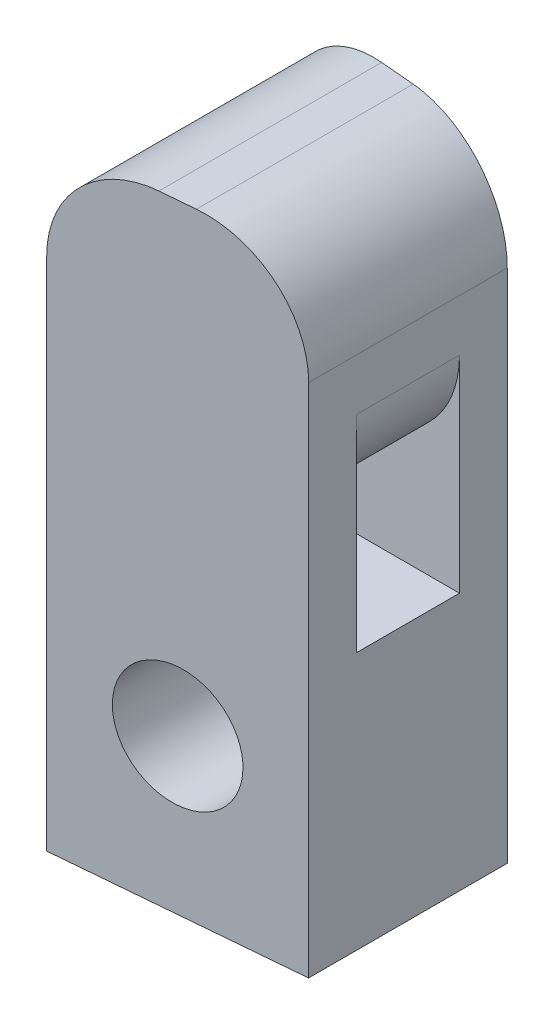
ISO-10303-21;
HEADER;
FILE_DESCRIPTION(('STEP AP214'),'2;1');
FILE_NAME('part.step','',(''),(''),'','','');
FILE_SCHEMA(('AUTOMOTIVE_DESIGN { 1 0 10303 214 1 1 1 1 }'));
ENDSEC;
DATA;
#1=APPLICATION_CONTEXT('core data for automotive mechanical design processes');
#2=APPLICATION_PROTOCOL_DEFINITION('international standard','automotive_design',2000,#1);
#3=PRODUCT_CONTEXT('',#1,'mechanical');
#4=PRODUCT('Part','Part','',(#3));
#5=PRODUCT_RELATED_PRODUCT_CATEGORY('part','',(#4));
#6=PRODUCT_DEFINITION_FORMATION('','',#4);
#7=PRODUCT_DEFINITION_CONTEXT('part definition',#1,'design');
#8=PRODUCT_DEFINITION('design','',#6,#7);
#9=PRODUCT_DEFINITION_SHAPE('','',#8);
#10=(LENGTH_UNIT() NAMED_UNIT(*) SI_UNIT(.MILLI.,.METRE.));
#11=(NAMED_UNIT(*) PLANE_ANGLE_UNIT() SI_UNIT($,.RADIAN.));
#12=(NAMED_UNIT(*) SI_UNIT($,.STERADIAN.) SOLID_ANGLE_UNIT());
#13=UNCERTAINTY_MEASURE_WITH_UNIT(LENGTH_MEASURE(1.E-05),#10,'distance_accuracy_value','');
#14=(GEOMETRIC_REPRESENTATION_CONTEXT(3) GLOBAL_UNCERTAINTY_ASSIGNED_CONTEXT((#13)) GLOBAL_UNIT_ASSIGNED_CONTEXT((#10,
#11,#12)) REPRESENTATION_CONTEXT('',''));
#15=CARTESIAN_POINT('',(0.,0.,0.));
#16=DIRECTION('',(0.,0.,1.));
#17=DIRECTION('',(1.,0.,0.));
#18=AXIS2_PLACEMENT_3D('',#15,#16,#17);
#19=CARTESIAN_POINT('',(2.335,10.,1.92642794133393));
#20=DIRECTION('',(-1.,0.,0.));
#21=DIRECTION('',(0.,0.,1.));
#22=AXIS2_PLACEMENT_3D('',#19,#20,#21);
#23=PLANE('',#22);
#24=DIRECTION('',(0.,-1.,0.));
#25=VECTOR('',#24,1.);
#26=CARTESIAN_POINT('',(2.335,5.,1.));
#27=LINE('',#26,#25);
#28=CARTESIAN_POINT('',(2.335,9.,1.));
#29=VERTEX_POINT('',#28);
#30=CARTESIAN_POINT('',(2.335,5.,1.));
#31=VERTEX_POINT('',#30);
#32=EDGE_CURVE('E151',#29,#31,#27,.T.);
#33=ORIENTED_EDGE('',*,*,#32,.F.);
#34=DIRECTION('',(0.,0.,1.));
#35=VECTOR('',#34,1.);
#36=CARTESIAN_POINT('',(2.335,9.,1.92642794133393));
#37=LINE('',#36,#35);
#38=CARTESIAN_POINT('',(2.335,9.,-1.));
#39=VERTEX_POINT('',#38);
#40=EDGE_CURVE('E223',#29,#39,#37,.F.);
#41=ORIENTED_EDGE('',*,*,#40,.T.);
#42=DIRECTION('',(0.,1.,0.));
#43=VECTOR('',#42,1.);
#44=CARTESIAN_POINT('',(2.335,5.,-1.));
#45=LINE('',#44,#43);
#46=CARTESIAN_POINT('',(2.335,5.,-1.));
#47=VERTEX_POINT('',#46);
#48=EDGE_CURVE('E156',#47,#39,#45,.T.);
#49=ORIENTED_EDGE('',*,*,#48,.F.);
#50=DIRECTION('',(0.,0.,-1.));
#51=VECTOR('',#50,1.);
#52=CARTESIAN_POINT('',(2.335,5.,1.));
#53=LINE('',#52,#51);
#54=EDGE_CURVE('E142',#31,#47,#53,.T.);
#55=ORIENTED_EDGE('',*,*,#54,.F.);
#56=EDGE_LOOP('',(#33,#41,#49,#55));
#57=FACE_BOUND('',#56,.T.);
#58=DIRECTION('',(0.,-1.,0.));
#59=VECTOR('',#58,1.);
#60=CARTESIAN_POINT('',(2.335,10.,-1.92642794133393));
#61=LINE('',#60,#59);
#62=CARTESIAN_POINT('',(2.335,10.,-1.92642794133393));
#63=VERTEX_POINT('',#62);
#64=CARTESIAN_POINT('',(2.335,0.,-1.92642794133393));
#65=VERTEX_POINT('',#64);
#66=EDGE_CURVE('E206',#63,#65,#61,.T.);
#67=ORIENTED_EDGE('',*,*,#66,.F.);
#68=DIRECTION('',(0.,0.,-1.));
#69=VECTOR('',#68,1.);
#70=CARTESIAN_POINT('',(2.335,10.,1.92642794133393));
#71=LINE('',#70,#69);
#72=CARTESIAN_POINT('',(2.335,10.,1.92642794133393));
#73=VERTEX_POINT('',#72);
#74=EDGE_CURVE('E226',#63,#73,#71,.F.);
#75=ORIENTED_EDGE('',*,*,#74,.T.);
#76=DIRECTION('',(0.,-1.,0.));
#77=VECTOR('',#76,1.);
#78=CARTESIAN_POINT('',(2.335,10.,1.92642794133393));
#79=LINE('',#78,#77);
#80=CARTESIAN_POINT('',(2.335,0.,1.92642794133393));
#81=VERTEX_POINT('',#80);
#82=EDGE_CURVE('E197',#73,#81,#79,.T.);
#83=ORIENTED_EDGE('',*,*,#82,.T.);
#84=DIRECTION('',(0.,0.,-1.));
#85=VECTOR('',#84,1.);
#86=CARTESIAN_POINT('',(2.335,0.,1.92642794133393));
#87=LINE('',#86,#85);
#88=EDGE_CURVE('E181',#81,#65,#87,.T.);
#89=ORIENTED_EDGE('',*,*,#88,.T.);
#90=EDGE_LOOP('',(#67,#75,#83,#89));
#91=FACE_BOUND('',#90,.T.);
#92=ADVANCED_FACE('F45',(#57,#91),#23,.F.);
#93=CARTESIAN_POINT('',(-2.335,10.,-2.335));
#94=DIRECTION('',(-0.0871557427476583,0.,0.996194698091746));
#95=DIRECTION('',(0.996194698091746,0.,0.0871557427476583));
#96=AXIS2_PLACEMENT_3D('',#93,#94,#95);
#97=PLANE('',#96);
#98=CARTESIAN_POINT('',(0.,3.,-2.13071397066697));
#99=DIRECTION('',(-0.0871557427476583,0.,0.996194698091746));
#100=DIRECTION('',(0.996194698091746,0.,0.0871557427476583));
#101=AXIS2_PLACEMENT_3D('',#98,#99,#100);
#102=ELLIPSE('',#101,1.169450110738,1.165);
#103=CARTESIAN_POINT('',(1.165,3.,-2.02878967765926));
#104=VERTEX_POINT('',#103);
#105=EDGE_CURVE('E263',#104,#104,#102,.T.);
#106=ORIENTED_EDGE('',*,*,#105,.T.);
#107=EDGE_LOOP('',(#106));
#108=FACE_BOUND('',#107,.T.);
#109=DIRECTION('',(-0.996194698091746,0.,-0.0871557427476583));
#110=VECTOR('',#109,1.);
#111=CARTESIAN_POINT('',(2.335,12.,-1.92642794133393));
#112=LINE('',#111,#110);
#113=CARTESIAN_POINT('',(0.334999999999999,12.,-2.10140526838578));
#114=VERTEX_POINT('',#113);
#115=CARTESIAN_POINT('',(-0.335,12.,-2.16002267294815));
#116=VERTEX_POINT('',#115);
#117=EDGE_CURVE('E176',#114,#116,#112,.T.);
#118=ORIENTED_EDGE('',*,*,#117,.F.);
#119=CARTESIAN_POINT('',(0.335,10.,-2.10140526838578));
#120=DIRECTION('',(-0.0871557427476583,0.,0.996194698091746));
#121=DIRECTION('',(0.996194698091746,0.,0.0871557427476583));
#122=AXIS2_PLACEMENT_3D('',#119,#120,#121);
#123=ELLIPSE('',#122,2.00763967508669,2.);
#124=EDGE_CURVE('E220',#114,#63,#123,.F.);
#125=ORIENTED_EDGE('',*,*,#124,.T.);
#126=ORIENTED_EDGE('',*,*,#66,.T.);
#127=DIRECTION('',(-0.996194698091746,0.,-0.0871557427476583));
#128=VECTOR('',#127,1.);
#129=CARTESIAN_POINT('',(-2.335,0.,-2.335));
#130=LINE('',#129,#128);
#131=CARTESIAN_POINT('',(-2.335,0.,-2.335));
#132=VERTEX_POINT('',#131);
#133=EDGE_CURVE('E185',#65,#132,#130,.T.);
#134=ORIENTED_EDGE('',*,*,#133,.T.);
#135=DIRECTION('',(0.,-1.,0.));
#136=VECTOR('',#135,1.);
#137=CARTESIAN_POINT('',(-2.335,10.,-2.335));
#138=LINE('',#137,#136);
#139=CARTESIAN_POINT('',(-2.335,10.,-2.335));
#140=VERTEX_POINT('',#139);
#141=EDGE_CURVE('E203',#140,#132,#138,.T.);
#142=ORIENTED_EDGE('',*,*,#141,.F.);
#143=CARTESIAN_POINT('',(-0.335,10.,-2.16002267294815));
#144=DIRECTION('',(-0.0871557427476583,0.,0.996194698091746));
#145=DIRECTION('',(-0.996194698091746,0.,-0.0871557427476583));
#146=AXIS2_PLACEMENT_3D('',#143,#144,#145);
#147=ELLIPSE('',#146,2.00763967508669,2.);
#148=EDGE_CURVE('E217',#140,#116,#147,.F.);
#149=ORIENTED_EDGE('',*,*,#148,.T.);
#150=EDGE_LOOP('',(#118,#125,#126,#134,#142,#149));
#151=FACE_BOUND('',#150,.T.);
#152=ADVANCED_FACE('F288',(#108,#151),#97,.F.);
#153=CARTESIAN_POINT('',(-2.335,10.,2.335));
#154=DIRECTION('',(1.,0.,0.));
#155=DIRECTION('',(0.,0.,-1.));
#156=AXIS2_PLACEMENT_3D('',#153,#154,#155);
#157=PLANE('',#156);
#158=DIRECTION('',(0.,-1.,0.));
#159=VECTOR('',#158,1.);
#160=CARTESIAN_POINT('',(-2.335,5.,-1.));
#161=LINE('',#160,#159);
#162=CARTESIAN_POINT('',(-2.335,9.,-1.));
#163=VERTEX_POINT('',#162);
#164=CARTESIAN_POINT('',(-2.335,5.,-1.));
#165=VERTEX_POINT('',#164);
#166=EDGE_CURVE('E177',#163,#165,#161,.T.);
#167=ORIENTED_EDGE('',*,*,#166,.F.);
#168=DIRECTION('',(0.,0.,-1.));
#169=VECTOR('',#168,1.);
#170=CARTESIAN_POINT('',(-2.335,9.,2.335));
#171=LINE('',#170,#169);
#172=CARTESIAN_POINT('',(-2.335,9.,1.));
#173=VERTEX_POINT('',#172);
#174=EDGE_CURVE('E235',#163,#173,#171,.F.);
#175=ORIENTED_EDGE('',*,*,#174,.T.);
#176=DIRECTION('',(0.,1.,0.));
#177=VECTOR('',#176,1.);
#178=CARTESIAN_POINT('',(-2.335,5.,1.));
#179=LINE('',#178,#177);
#180=CARTESIAN_POINT('',(-2.335,5.,1.));
#181=VERTEX_POINT('',#180);
#182=EDGE_CURVE('E168',#181,#173,#179,.T.);
#183=ORIENTED_EDGE('',*,*,#182,.F.);
#184=DIRECTION('',(0.,0.,1.));
#185=VECTOR('',#184,1.);
#186=CARTESIAN_POINT('',(-2.335,5.,1.));
#187=LINE('',#186,#185);
#188=EDGE_CURVE('E145',#165,#181,#187,.T.);
#189=ORIENTED_EDGE('',*,*,#188,.F.);
#190=EDGE_LOOP('',(#167,#175,#183,#189));
#191=FACE_BOUND('',#190,.T.);
#192=DIRECTION('',(0.,-1.,0.));
#193=VECTOR('',#192,1.);
#194=CARTESIAN_POINT('',(-2.335,10.,2.335));
#195=LINE('',#194,#193);
#196=CARTESIAN_POINT('',(-2.335,10.,2.335));
#197=VERTEX_POINT('',#196);
#198=CARTESIAN_POINT('',(-2.335,0.,2.335));
#199=VERTEX_POINT('',#198);
#200=EDGE_CURVE('E200',#197,#199,#195,.T.);
#201=ORIENTED_EDGE('',*,*,#200,.F.);
#202=DIRECTION('',(0.,0.,1.));
#203=VECTOR('',#202,1.);
#204=CARTESIAN_POINT('',(-2.335,10.,-2.335));
#205=LINE('',#204,#203);
#206=EDGE_CURVE('E239',#197,#140,#205,.F.);
#207=ORIENTED_EDGE('',*,*,#206,.T.);
#208=ORIENTED_EDGE('',*,*,#141,.T.);
#209=DIRECTION('',(0.,0.,1.));
#210=VECTOR('',#209,1.);
#211=CARTESIAN_POINT('',(-2.335,0.,2.335));
#212=LINE('',#211,#210);
#213=EDGE_CURVE('E189',#132,#199,#212,.T.);
#214=ORIENTED_EDGE('',*,*,#213,.T.);
#215=EDGE_LOOP('',(#201,#207,#208,#214));
#216=FACE_BOUND('',#215,.T.);
#217=ADVANCED_FACE('F295',(#191,#216),#157,.F.);
#218=CARTESIAN_POINT('',(-2.335,10.,2.335));
#219=DIRECTION('',(-0.0871557427476583,0.,-0.996194698091746));
#220=DIRECTION('',(-0.996194698091746,0.,0.0871557427476583));
#221=AXIS2_PLACEMENT_3D('',#218,#219,#220);
#222=PLANE('',#221);
#223=CARTESIAN_POINT('',(0.,3.,2.13071397066697));
#224=DIRECTION('',(-0.0871557427476583,0.,-0.996194698091746));
#225=DIRECTION('',(-0.996194698091746,0.,0.0871557427476583));
#226=AXIS2_PLACEMENT_3D('',#223,#224,#225);
#227=ELLIPSE('',#226,1.169450110738,1.165);
#228=CARTESIAN_POINT('',(-1.165,3.,2.23263826367467));
#229=VERTEX_POINT('',#228);
#230=EDGE_CURVE('E49',#229,#229,#227,.T.);
#231=ORIENTED_EDGE('',*,*,#230,.T.);
#232=EDGE_LOOP('',(#231));
#233=FACE_BOUND('',#232,.T.);
#234=ORIENTED_EDGE('',*,*,#82,.F.);
#235=CARTESIAN_POINT('',(0.335,10.,2.10140526838578));
#236=DIRECTION('',(-0.0871557427476583,0.,-0.996194698091746));
#237=DIRECTION('',(-0.996194698091746,0.,0.0871557427476583));
#238=AXIS2_PLACEMENT_3D('',#235,#236,#237);
#239=ELLIPSE('',#238,2.00763967508669,2.);
#240=CARTESIAN_POINT('',(0.335,12.,2.10140526838578));
#241=VERTEX_POINT('',#240);
#242=EDGE_CURVE('E232',#73,#241,#239,.F.);
#243=ORIENTED_EDGE('',*,*,#242,.T.);
#244=DIRECTION('',(0.996194698091746,0.,-0.0871557427476583));
#245=VECTOR('',#244,1.);
#246=CARTESIAN_POINT('',(-2.335,12.,2.335));
#247=LINE('',#246,#245);
#248=CARTESIAN_POINT('',(-0.334999999999999,12.,2.16002267294815));
#249=VERTEX_POINT('',#248);
#250=EDGE_CURVE('E172',#249,#241,#247,.T.);
#251=ORIENTED_EDGE('',*,*,#250,.F.);
#252=CARTESIAN_POINT('',(-0.335,10.,2.16002267294815));
#253=DIRECTION('',(-0.0871557427476583,0.,-0.996194698091746));
#254=DIRECTION('',(0.996194698091746,0.,-0.0871557427476583));
#255=AXIS2_PLACEMENT_3D('',#252,#253,#254);
#256=ELLIPSE('',#255,2.00763967508669,2.);
#257=EDGE_CURVE('E229',#249,#197,#256,.F.);
#258=ORIENTED_EDGE('',*,*,#257,.T.);
#259=ORIENTED_EDGE('',*,*,#200,.T.);
#260=DIRECTION('',(0.996194698091746,0.,-0.0871557427476583));
#261=VECTOR('',#260,1.);
#262=CARTESIAN_POINT('',(-2.335,0.,2.335));
#263=LINE('',#262,#261);
#264=EDGE_CURVE('E193',#199,#81,#263,.T.);
#265=ORIENTED_EDGE('',*,*,#264,.T.);
#266=EDGE_LOOP('',(#234,#243,#251,#258,#259,#265));
#267=FACE_BOUND('',#266,.T.);
#268=ADVANCED_FACE('F274',(#233,#267),#222,.F.);
#269=CARTESIAN_POINT('',(0.,0.,0.));
#270=DIRECTION('',(0.,-1.,0.));
#271=DIRECTION('',(0.,0.,-1.));
#272=AXIS2_PLACEMENT_3D('',#269,#270,#271);
#273=PLANE('',#272);
#274=ORIENTED_EDGE('',*,*,#88,.F.);
#275=ORIENTED_EDGE('',*,*,#264,.F.);
#276=ORIENTED_EDGE('',*,*,#213,.F.);
#277=ORIENTED_EDGE('',*,*,#133,.F.);
#278=EDGE_LOOP('',(#274,#275,#276,#277));
#279=FACE_BOUND('',#278,.T.);
#280=ADVANCED_FACE('F339',(#279),#273,.T.);
#281=CARTESIAN_POINT('',(0.,12.,0.));
#282=DIRECTION('',(0.,1.,0.));
#283=DIRECTION('',(0.,0.,1.));
#284=AXIS2_PLACEMENT_3D('',#281,#282,#283);
#285=PLANE('',#284);
#286=ORIENTED_EDGE('',*,*,#250,.T.);
#287=DIRECTION('',(0.,0.,-1.));
#288=VECTOR('',#287,1.);
#289=CARTESIAN_POINT('',(0.335,12.,-1.92642794133393));
#290=LINE('',#289,#288);
#291=EDGE_CURVE('E213',#241,#114,#290,.T.);
#292=ORIENTED_EDGE('',*,*,#291,.T.);
#293=ORIENTED_EDGE('',*,*,#117,.T.);
#294=DIRECTION('',(0.,0.,1.));
#295=VECTOR('',#294,1.);
#296=CARTESIAN_POINT('',(-0.335,12.,2.335));
#297=LINE('',#296,#295);
#298=EDGE_CURVE('E209',#116,#249,#297,.T.);
#299=ORIENTED_EDGE('',*,*,#298,.T.);
#300=EDGE_LOOP('',(#286,#292,#293,#299));
#301=FACE_BOUND('',#300,.T.);
#302=ADVANCED_FACE('F329',(#301),#285,.T.);
#303=CARTESIAN_POINT('',(-5.16342712474619,5.,-1.));
#304=DIRECTION('',(0.,0.,-1.));
#305=DIRECTION('',(-1.,0.,0.));
#306=AXIS2_PLACEMENT_3D('',#303,#304,#305);
#307=PLANE('',#306);
#308=ORIENTED_EDGE('',*,*,#166,.T.);
#309=DIRECTION('',(1.,0.,0.));
#310=VECTOR('',#309,1.);
#311=CARTESIAN_POINT('',(-5.16342712474619,5.,-1.));
#312=LINE('',#311,#310);
#313=EDGE_CURVE('E148',#165,#47,#312,.T.);
#314=ORIENTED_EDGE('',*,*,#313,.T.);
#315=ORIENTED_EDGE('',*,*,#48,.T.);
#316=CARTESIAN_POINT('',(0.335,9.,-1.));
#317=DIRECTION('',(0.,0.,-1.));
#318=DIRECTION('',(-1.,0.,0.));
#319=AXIS2_PLACEMENT_3D('',#316,#317,#318);
#320=CIRCLE('',#319,2.);
#321=CARTESIAN_POINT('',(0.334999999999999,7.,-1.));
#322=VERTEX_POINT('',#321);
#323=EDGE_CURVE('E11',#39,#322,#320,.T.);
#324=ORIENTED_EDGE('',*,*,#323,.T.);
#325=DIRECTION('',(1.,0.,0.));
#326=VECTOR('',#325,1.);
#327=CARTESIAN_POINT('',(-5.16342712474619,7.,-1.));
#328=LINE('',#327,#326);
#329=CARTESIAN_POINT('',(-0.335000000000002,7.,-1.));
#330=VERTEX_POINT('',#329);
#331=EDGE_CURVE('E160',#330,#322,#328,.T.);
#332=ORIENTED_EDGE('',*,*,#331,.F.);
#333=CARTESIAN_POINT('',(-0.335,9.,-1.));
#334=DIRECTION('',(0.,0.,-1.));
#335=DIRECTION('',(-1.,0.,0.));
#336=AXIS2_PLACEMENT_3D('',#333,#334,#335);
#337=CIRCLE('',#336,2.);
#338=EDGE_CURVE('E249',#330,#163,#337,.T.);
#339=ORIENTED_EDGE('',*,*,#338,.T.);
#340=EDGE_LOOP('',(#308,#314,#315,#324,#332,#339));
#341=FACE_BOUND('',#340,.T.);
#342=ADVANCED_FACE('F315',(#341),#307,.F.);
#343=CARTESIAN_POINT('',(-5.16342712474619,5.,1.));
#344=DIRECTION('',(0.,-1.,0.));
#345=DIRECTION('',(0.,0.,-1.));
#346=AXIS2_PLACEMENT_3D('',#343,#344,#345);
#347=PLANE('',#346);
#348=ORIENTED_EDGE('',*,*,#188,.T.);
#349=DIRECTION('',(1.,0.,0.));
#350=VECTOR('',#349,1.);
#351=CARTESIAN_POINT('',(-5.16342712474619,5.,1.));
#352=LINE('',#351,#350);
#353=EDGE_CURVE('E137',#181,#31,#352,.T.);
#354=ORIENTED_EDGE('',*,*,#353,.T.);
#355=ORIENTED_EDGE('',*,*,#54,.T.);
#356=ORIENTED_EDGE('',*,*,#313,.F.);
#357=EDGE_LOOP('',(#348,#354,#355,#356));
#358=FACE_BOUND('',#357,.T.);
#359=ADVANCED_FACE('F139',(#358),#347,.F.);
#360=CARTESIAN_POINT('',(-5.16342712474619,5.,1.));
#361=DIRECTION('',(0.,0.,1.));
#362=DIRECTION('',(1.,0.,0.));
#363=AXIS2_PLACEMENT_3D('',#360,#361,#362);
#364=PLANE('',#363);
#365=ORIENTED_EDGE('',*,*,#182,.T.);
#366=CARTESIAN_POINT('',(-0.335,9.,1.));
#367=DIRECTION('',(0.,0.,1.));
#368=DIRECTION('',(1.,0.,0.));
#369=AXIS2_PLACEMENT_3D('',#366,#367,#368);
#370=CIRCLE('',#369,2.);
#371=CARTESIAN_POINT('',(-0.335000000000002,7.,1.));
#372=VERTEX_POINT('',#371);
#373=EDGE_CURVE('E69',#173,#372,#370,.T.);
#374=ORIENTED_EDGE('',*,*,#373,.T.);
#375=DIRECTION('',(1.,0.,0.));
#376=VECTOR('',#375,1.);
#377=CARTESIAN_POINT('',(-5.16342712474619,7.,1.));
#378=LINE('',#377,#376);
#379=CARTESIAN_POINT('',(0.334999999999999,7.,1.));
#380=VERTEX_POINT('',#379);
#381=EDGE_CURVE('E149',#372,#380,#378,.T.);
#382=ORIENTED_EDGE('',*,*,#381,.T.);
#383=CARTESIAN_POINT('',(0.335,9.,1.));
#384=DIRECTION('',(0.,0.,1.));
#385=DIRECTION('',(1.,0.,0.));
#386=AXIS2_PLACEMENT_3D('',#383,#384,#385);
#387=CIRCLE('',#386,2.);
#388=EDGE_CURVE('E55',#380,#29,#387,.T.);
#389=ORIENTED_EDGE('',*,*,#388,.T.);
#390=ORIENTED_EDGE('',*,*,#32,.T.);
#391=ORIENTED_EDGE('',*,*,#353,.F.);
#392=EDGE_LOOP('',(#365,#374,#382,#389,#390,#391));
#393=FACE_BOUND('',#392,.T.);
#394=ADVANCED_FACE('F152',(#393),#364,.F.);
#395=CARTESIAN_POINT('',(-5.16342712474619,7.,1.));
#396=DIRECTION('',(0.,1.,0.));
#397=DIRECTION('',(0.,0.,1.));
#398=AXIS2_PLACEMENT_3D('',#395,#396,#397);
#399=PLANE('',#398);
#400=ORIENTED_EDGE('',*,*,#381,.F.);
#401=DIRECTION('',(0.,0.,-1.));
#402=VECTOR('',#401,1.);
#403=CARTESIAN_POINT('',(-0.335,7.,1.));
#404=LINE('',#403,#402);
#405=EDGE_CURVE('E245',#372,#330,#404,.T.);
#406=ORIENTED_EDGE('',*,*,#405,.T.);
#407=ORIENTED_EDGE('',*,*,#331,.T.);
#408=DIRECTION('',(0.,0.,1.));
#409=VECTOR('',#408,1.);
#410=CARTESIAN_POINT('',(0.335,7.,1.));
#411=LINE('',#410,#409);
#412=EDGE_CURVE('E242',#322,#380,#411,.T.);
#413=ORIENTED_EDGE('',*,*,#412,.T.);
#414=EDGE_LOOP('',(#400,#406,#407,#413));
#415=FACE_BOUND('',#414,.T.);
#416=ADVANCED_FACE('F303',(#415),#399,.F.);
#417=CARTESIAN_POINT('',(0.335,10.,0.));
#418=DIRECTION('',(0.,0.,1.));
#419=DIRECTION('',(1.,0.,0.));
#420=AXIS2_PLACEMENT_3D('',#417,#418,#419);
#421=CYLINDRICAL_SURFACE('',#420,2.);
#422=ORIENTED_EDGE('',*,*,#242,.F.);
#423=ORIENTED_EDGE('',*,*,#74,.F.);
#424=ORIENTED_EDGE('',*,*,#124,.F.);
#425=ORIENTED_EDGE('',*,*,#291,.F.);
#426=EDGE_LOOP('',(#422,#423,#424,#425));
#427=FACE_BOUND('',#426,.T.);
#428=ADVANCED_FACE('F299',(#427),#421,.T.);
#429=CARTESIAN_POINT('',(-0.335,10.,0.));
#430=DIRECTION('',(0.,0.,-1.));
#431=DIRECTION('',(-1.,0.,0.));
#432=AXIS2_PLACEMENT_3D('',#429,#430,#431);
#433=CYLINDRICAL_SURFACE('',#432,2.);
#434=ORIENTED_EDGE('',*,*,#148,.F.);
#435=ORIENTED_EDGE('',*,*,#206,.F.);
#436=ORIENTED_EDGE('',*,*,#257,.F.);
#437=ORIENTED_EDGE('',*,*,#298,.F.);
#438=EDGE_LOOP('',(#434,#435,#436,#437));
#439=FACE_BOUND('',#438,.T.);
#440=ADVANCED_FACE('F302',(#439),#433,.T.);
#441=CARTESIAN_POINT('',(-0.335,9.,1.));
#442=DIRECTION('',(0.,0.,-1.));
#443=DIRECTION('',(-1.,0.,0.));
#444=AXIS2_PLACEMENT_3D('',#441,#442,#443);
#445=CYLINDRICAL_SURFACE('',#444,2.);
#446=ORIENTED_EDGE('',*,*,#373,.F.);
#447=ORIENTED_EDGE('',*,*,#174,.F.);
#448=ORIENTED_EDGE('',*,*,#338,.F.);
#449=ORIENTED_EDGE('',*,*,#405,.F.);
#450=EDGE_LOOP('',(#446,#447,#448,#449));
#451=FACE_BOUND('',#450,.T.);
#452=ADVANCED_FACE('F285',(#451),#445,.T.);
#453=CARTESIAN_POINT('',(0.335,9.,1.));
#454=DIRECTION('',(0.,0.,1.));
#455=DIRECTION('',(1.,0.,0.));
#456=AXIS2_PLACEMENT_3D('',#453,#454,#455);
#457=CYLINDRICAL_SURFACE('',#456,2.);
#458=ORIENTED_EDGE('',*,*,#323,.F.);
#459=ORIENTED_EDGE('',*,*,#40,.F.);
#460=ORIENTED_EDGE('',*,*,#388,.F.);
#461=ORIENTED_EDGE('',*,*,#412,.F.);
#462=EDGE_LOOP('',(#458,#459,#460,#461));
#463=FACE_BOUND('',#462,.T.);
#464=ADVANCED_FACE('F47',(#463),#457,.T.);
#465=CARTESIAN_POINT('',(0.,3.,-2.335));
#466=DIRECTION('',(0.,0.,1.));
#467=DIRECTION('',(1.,0.,0.));
#468=AXIS2_PLACEMENT_3D('',#465,#466,#467);
#469=CYLINDRICAL_SURFACE('',#468,1.165);
#470=ORIENTED_EDGE('',*,*,#230,.F.);
#471=EDGE_LOOP('',(#470));
#472=FACE_BOUND('',#471,.T.);
#473=ORIENTED_EDGE('',*,*,#105,.F.);
#474=EDGE_LOOP('',(#473));
#475=FACE_BOUND('',#474,.T.);
#476=ADVANCED_FACE('F277',(#472,#475),#469,.F.);
#477=CLOSED_SHELL('',(#92,#152,#217,#268,#280,#302,#342,#359,#394,#416,#428,#440,#452,#464,#476));
#478=MANIFOLD_SOLID_BREP('B2',#477);
#479=ADVANCED_BREP_SHAPE_REPRESENTATION('',(#18,#478),#14);
#480=SHAPE_DEFINITION_REPRESENTATION(#9,#479);
ENDSEC;
END-ISO-10303-21;
